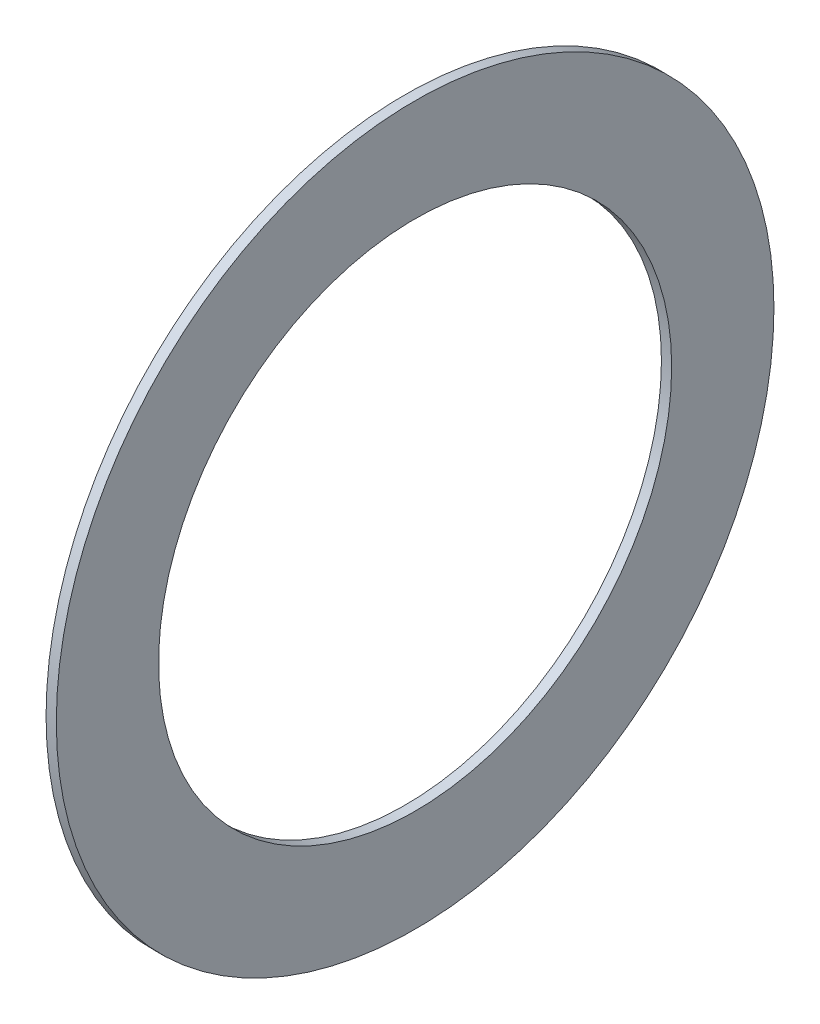
ISO-10303-21;
HEADER;
FILE_DESCRIPTION(('STEP AP214'),'2;1');
FILE_NAME('part.step','',(''),(''),'','','');
FILE_SCHEMA(('AUTOMOTIVE_DESIGN { 1 0 10303 214 1 1 1 1 }'));
ENDSEC;
DATA;
#1=APPLICATION_CONTEXT('core data for automotive mechanical design processes');
#2=APPLICATION_PROTOCOL_DEFINITION('international standard','automotive_design',2000,#1);
#3=PRODUCT_CONTEXT('',#1,'mechanical');
#4=PRODUCT('Part','Part','',(#3));
#5=PRODUCT_RELATED_PRODUCT_CATEGORY('part','',(#4));
#6=PRODUCT_DEFINITION_FORMATION('','',#4);
#7=PRODUCT_DEFINITION_CONTEXT('part definition',#1,'design');
#8=PRODUCT_DEFINITION('design','',#6,#7);
#9=PRODUCT_DEFINITION_SHAPE('','',#8);
#10=(LENGTH_UNIT() NAMED_UNIT(*) SI_UNIT(.MILLI.,.METRE.));
#11=(NAMED_UNIT(*) PLANE_ANGLE_UNIT() SI_UNIT($,.RADIAN.));
#12=(NAMED_UNIT(*) SI_UNIT($,.STERADIAN.) SOLID_ANGLE_UNIT());
#13=UNCERTAINTY_MEASURE_WITH_UNIT(LENGTH_MEASURE(1.E-05),#10,'distance_accuracy_value','');
#14=(GEOMETRIC_REPRESENTATION_CONTEXT(3) GLOBAL_UNCERTAINTY_ASSIGNED_CONTEXT((#13)) GLOBAL_UNIT_ASSIGNED_CONTEXT((#10,
#11,#12)) REPRESENTATION_CONTEXT('',''));
#15=CARTESIAN_POINT('',(0.,0.,0.));
#16=DIRECTION('',(0.,0.,1.));
#17=DIRECTION('',(1.,0.,0.));
#18=AXIS2_PLACEMENT_3D('',#15,#16,#17);
#19=CARTESIAN_POINT('',(0.499999999999976,0.,0.));
#20=DIRECTION('',(1.,0.,0.));
#21=DIRECTION('',(0.,0.,-1.));
#22=AXIS2_PLACEMENT_3D('',#19,#20,#21);
#23=PLANE('',#22);
#24=CARTESIAN_POINT('',(0.499999999999976,0.,0.));
#25=DIRECTION('',(1.,0.,0.));
#26=DIRECTION('',(0.,0.,-1.));
#27=AXIS2_PLACEMENT_3D('',#24,#25,#26);
#28=CIRCLE('',#27,35.);
#29=CARTESIAN_POINT('',(0.499999999999976,0.,-35.));
#30=VERTEX_POINT('',#29);
#31=EDGE_CURVE('E10',#30,#30,#28,.T.);
#32=ORIENTED_EDGE('',*,*,#31,.T.);
#33=EDGE_LOOP('',(#32));
#34=FACE_BOUND('',#33,.T.);
#35=CARTESIAN_POINT('',(0.499999999999976,0.,0.));
#36=DIRECTION('',(1.,0.,0.));
#37=DIRECTION('',(0.,0.,-1.));
#38=AXIS2_PLACEMENT_3D('',#35,#36,#37);
#39=CIRCLE('',#38,25.025);
#40=CARTESIAN_POINT('',(0.499999999999976,0.,-25.025));
#41=VERTEX_POINT('',#40);
#42=EDGE_CURVE('E42',#41,#41,#39,.T.);
#43=ORIENTED_EDGE('',*,*,#42,.F.);
#44=EDGE_LOOP('',(#43));
#45=FACE_BOUND('',#44,.T.);
#46=ADVANCED_FACE('F35',(#34,#45),#23,.T.);
#47=CARTESIAN_POINT('',(0.499999999999976,0.,0.));
#48=DIRECTION('',(-1.,0.,0.));
#49=DIRECTION('',(0.,0.,1.));
#50=AXIS2_PLACEMENT_3D('',#47,#48,#49);
#51=CYLINDRICAL_SURFACE('',#50,35.);
#52=ORIENTED_EDGE('',*,*,#31,.F.);
#53=EDGE_LOOP('',(#52));
#54=FACE_BOUND('',#53,.T.);
#55=CARTESIAN_POINT('',(-0.500000000000024,0.,0.));
#56=DIRECTION('',(1.,0.,0.));
#57=DIRECTION('',(0.,0.,-1.));
#58=AXIS2_PLACEMENT_3D('',#55,#56,#57);
#59=CIRCLE('',#58,35.);
#60=CARTESIAN_POINT('',(-0.500000000000024,0.,-35.));
#61=VERTEX_POINT('',#60);
#62=EDGE_CURVE('E46',#61,#61,#59,.T.);
#63=ORIENTED_EDGE('',*,*,#62,.T.);
#64=EDGE_LOOP('',(#63));
#65=FACE_BOUND('',#64,.T.);
#66=ADVANCED_FACE('F37',(#54,#65),#51,.T.);
#67=CARTESIAN_POINT('',(0.499999999999976,0.,0.));
#68=DIRECTION('',(-1.,0.,0.));
#69=DIRECTION('',(0.,0.,1.));
#70=AXIS2_PLACEMENT_3D('',#67,#68,#69);
#71=CYLINDRICAL_SURFACE('',#70,25.025);
#72=ORIENTED_EDGE('',*,*,#42,.T.);
#73=EDGE_LOOP('',(#72));
#74=FACE_BOUND('',#73,.T.);
#75=CARTESIAN_POINT('',(-0.500000000000024,0.,0.));
#76=DIRECTION('',(1.,0.,0.));
#77=DIRECTION('',(0.,0.,-1.));
#78=AXIS2_PLACEMENT_3D('',#75,#76,#77);
#79=CIRCLE('',#78,25.025);
#80=CARTESIAN_POINT('',(-0.500000000000024,0.,-25.025));
#81=VERTEX_POINT('',#80);
#82=EDGE_CURVE('E50',#81,#81,#79,.T.);
#83=ORIENTED_EDGE('',*,*,#82,.F.);
#84=EDGE_LOOP('',(#83));
#85=FACE_BOUND('',#84,.T.);
#86=ADVANCED_FACE('F59',(#74,#85),#71,.F.);
#87=CARTESIAN_POINT('',(-0.500000000000024,0.,0.));
#88=DIRECTION('',(1.,0.,0.));
#89=DIRECTION('',(0.,0.,-1.));
#90=AXIS2_PLACEMENT_3D('',#87,#88,#89);
#91=PLANE('',#90);
#92=ORIENTED_EDGE('',*,*,#82,.T.);
#93=EDGE_LOOP('',(#92));
#94=FACE_BOUND('',#93,.T.);
#95=ORIENTED_EDGE('',*,*,#62,.F.);
#96=EDGE_LOOP('',(#95));
#97=FACE_BOUND('',#96,.T.);
#98=ADVANCED_FACE('F56',(#94,#97),#91,.F.);
#99=CLOSED_SHELL('',(#46,#66,#86,#98));
#100=MANIFOLD_SOLID_BREP('B2',#99);
#101=ADVANCED_BREP_SHAPE_REPRESENTATION('',(#18,#100),#14);
#102=SHAPE_DEFINITION_REPRESENTATION(#9,#101);
ENDSEC;
END-ISO-10303-21;
